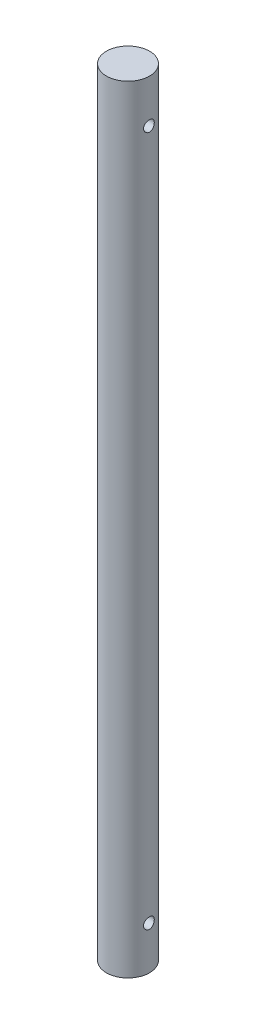
ISO-10303-21;
HEADER;
FILE_DESCRIPTION(('STEP AP214'),'2;1');
FILE_NAME('part.step','',(''),(''),'','','');
FILE_SCHEMA(('AUTOMOTIVE_DESIGN { 1 0 10303 214 1 1 1 1 }'));
ENDSEC;
DATA;
#1=APPLICATION_CONTEXT('core data for automotive mechanical design processes');
#2=APPLICATION_PROTOCOL_DEFINITION('international standard','automotive_design',2000,#1);
#3=PRODUCT_CONTEXT('',#1,'mechanical');
#4=PRODUCT('Part','Part','',(#3));
#5=PRODUCT_RELATED_PRODUCT_CATEGORY('part','',(#4));
#6=PRODUCT_DEFINITION_FORMATION('','',#4);
#7=PRODUCT_DEFINITION_CONTEXT('part definition',#1,'design');
#8=PRODUCT_DEFINITION('design','',#6,#7);
#9=PRODUCT_DEFINITION_SHAPE('','',#8);
#10=(LENGTH_UNIT() NAMED_UNIT(*) SI_UNIT(.MILLI.,.METRE.));
#11=(NAMED_UNIT(*) PLANE_ANGLE_UNIT() SI_UNIT($,.RADIAN.));
#12=(NAMED_UNIT(*) SI_UNIT($,.STERADIAN.) SOLID_ANGLE_UNIT());
#13=UNCERTAINTY_MEASURE_WITH_UNIT(LENGTH_MEASURE(1.E-05),#10,'distance_accuracy_value','');
#14=(GEOMETRIC_REPRESENTATION_CONTEXT(3) GLOBAL_UNCERTAINTY_ASSIGNED_CONTEXT((#13)) GLOBAL_UNIT_ASSIGNED_CONTEXT((#10,
#11,#12)) REPRESENTATION_CONTEXT('',''));
#15=CARTESIAN_POINT('',(0.,0.,0.));
#16=DIRECTION('',(0.,0.,1.));
#17=DIRECTION('',(1.,0.,0.));
#18=AXIS2_PLACEMENT_3D('',#15,#16,#17);
#19=CARTESIAN_POINT('',(0.,914.4,0.));
#20=DIRECTION('',(0.,-1.,0.));
#21=DIRECTION('',(0.,0.,-1.));
#22=AXIS2_PLACEMENT_3D('',#19,#20,#21);
#23=CYLINDRICAL_SURFACE('',#22,25.4);
#24=CARTESIAN_POINT('',(-24.5934442484171,50.8,-6.35));
#25=CARTESIAN_POINT('',(-24.5934406881185,50.9753809478709,-6.35000528556476));
#26=CARTESIAN_POINT('',(-24.5953234043176,51.1507045038508,-6.34273309524765));
#27=CARTESIAN_POINT('',(-24.6027886856043,51.5001205041009,-6.31371849265363));
#28=CARTESIAN_POINT('',(-24.6083716749099,51.6742128049008,-6.2919744212459));
#29=CARTESIAN_POINT('',(-24.6230748088789,52.0199034531831,-6.23418528983497));
#30=CARTESIAN_POINT('',(-24.6321960945666,52.1915009776153,-6.19813561649682));
#31=CARTESIAN_POINT('',(-24.6537047042707,52.5310008319188,-6.11202207752963));
#32=CARTESIAN_POINT('',(-24.6660932364349,52.6989017699476,-6.06195302745435));
#33=CARTESIAN_POINT('',(-24.6937457456566,53.0295003900433,-5.94830490839853));
#34=CARTESIAN_POINT('',(-24.7090048357899,53.1922063734196,-5.88474877702497));
#35=CARTESIAN_POINT('',(-24.7419779358074,53.5116840133042,-5.7445376552918));
#36=CARTESIAN_POINT('',(-24.7596928524026,53.6684534506488,-5.66787782449343));
#37=CARTESIAN_POINT('',(-24.7970663241636,53.9749214396965,-5.50206487626491));
#38=CARTESIAN_POINT('',(-24.8167241867281,54.1246224831482,-5.41291620603053));
#39=CARTESIAN_POINT('',(-24.8574530276887,54.4161182506485,-5.22268993895708));
#40=CARTESIAN_POINT('',(-24.8785245362001,54.5579099717937,-5.12160785618681));
#41=CARTESIAN_POINT('',(-24.9219211919164,54.8353179753805,-4.90613414395909));
#42=CARTESIAN_POINT('',(-24.9442627651316,54.9707601236242,-4.79152157744859));
#43=CARTESIAN_POINT('',(-24.9892006656756,55.2316099102635,-4.55134895600639));
#44=CARTESIAN_POINT('',(-25.0117970844885,55.3570138052799,-4.42578485325958));
#45=CARTESIAN_POINT('',(-25.0566084802586,55.5968749991879,-4.16460304463346));
#46=CARTESIAN_POINT('',(-25.0788235588208,55.7113352522631,-4.02898806958627));
#47=CARTESIAN_POINT('',(-25.1222781225302,55.9286154460513,-3.74850445562388));
#48=CARTESIAN_POINT('',(-25.1435172452899,56.0314310833635,-3.60363242639595));
#49=CARTESIAN_POINT('',(-25.1847117192072,56.2259903922436,-3.30356479587755));
#50=CARTESIAN_POINT('',(-25.2046452842228,56.3175615021777,-3.14825423313342));
#51=CARTESIAN_POINT('',(-25.2423375460957,56.4872623108398,-2.83020069429101));
#52=CARTESIAN_POINT('',(-25.2600962449084,56.5653920216539,-2.66745772487585));
#53=CARTESIAN_POINT('',(-25.2929297289925,56.7075868220732,-2.33569777096007));
#54=CARTESIAN_POINT('',(-25.3080048336936,56.7716535858119,-2.16668153606842));
#55=CARTESIAN_POINT('',(-25.3350387694815,56.8852060962506,-1.82357341907634));
#56=CARTESIAN_POINT('',(-25.3469976007183,56.9346918436528,-1.64948153722034));
#57=CARTESIAN_POINT('',(-25.3672410071466,57.0177977117507,-1.30111425103593));
#58=CARTESIAN_POINT('',(-25.3755956955843,57.0517214848189,-1.12691535020305));
#59=CARTESIAN_POINT('',(-25.3887474994447,57.1048919129797,-0.776098045700244));
#60=CARTESIAN_POINT('',(-25.3935433897817,57.1241335139256,-0.599478830147043));
#61=CARTESIAN_POINT('',(-25.3994326143973,57.1477413018827,-0.245262951434046));
#62=CARTESIAN_POINT('',(-25.4005277836517,57.1521148611118,-0.067666816442157));
#63=CARTESIAN_POINT('',(-25.3989975519053,57.1459863468102,0.287270447782051));
#64=CARTESIAN_POINT('',(-25.3963707890385,57.1354788282495,0.464611459893163));
#65=CARTESIAN_POINT('',(-25.3831796615053,57.0824973089046,0.986274984276417));
#66=CARTESIAN_POINT('',(-25.3674351284754,57.0190970451158,1.32859320268169));
#67=CARTESIAN_POINT('',(-25.3235693788275,56.8376536633609,1.997374640484));
#68=CARTESIAN_POINT('',(-25.2954475033714,56.7196076366174,2.32383701485701));
#69=CARTESIAN_POINT('',(-25.2295021677704,56.4311732833029,2.95531715335712));
#70=CARTESIAN_POINT('',(-25.1915933450496,56.2603216563659,3.26011450287544));
#71=CARTESIAN_POINT('',(-25.1101837119969,55.8714766252467,3.83715433672366));
#72=CARTESIAN_POINT('',(-25.0666819293206,55.6534750194644,4.10939114443232));
#73=CARTESIAN_POINT('',(-24.9774382864578,55.1695397813881,4.6213639707933));
#74=CARTESIAN_POINT('',(-24.9316676642111,54.9024685697296,4.86002095349375));
#75=CARTESIAN_POINT('',(-24.8441221170721,54.331616070915,5.28940029601336));
#76=CARTESIAN_POINT('',(-24.8023473789918,54.0278330689441,5.48012041540997));
#77=CARTESIAN_POINT('',(-24.7274206158047,53.3900633123974,5.80890453638017));
#78=CARTESIAN_POINT('',(-24.6943113835849,53.0559372452995,5.94670872944325));
#79=CARTESIAN_POINT('',(-24.6410134587475,52.3682329110486,6.16385371173043));
#80=CARTESIAN_POINT('',(-24.6208220013423,52.0146588239546,6.24320701173318));
#81=CARTESIAN_POINT('',(-24.5962260426512,51.3081028676093,6.3394072820919));
#82=CARTESIAN_POINT('',(-24.5914186592818,50.9553520107603,6.35784982289844));
#83=CARTESIAN_POINT('',(-24.5970385221954,50.2518122752274,6.33607313676639));
#84=CARTESIAN_POINT('',(-24.6074643660761,49.9010232189204,6.29585930985405));
#85=CARTESIAN_POINT('',(-24.6419898794769,49.2172897885605,6.15931075383293));
#86=CARTESIAN_POINT('',(-24.6658630331987,48.8841473542729,6.06390501416597));
#87=CARTESIAN_POINT('',(-24.7243782548382,48.2385840172845,5.82070964667977));
#88=CARTESIAN_POINT('',(-24.7590215983708,47.926165574442,5.67291381351808));
#89=CARTESIAN_POINT('',(-24.8360218405114,47.3241594576116,5.32579856478302));
#90=CARTESIAN_POINT('',(-24.8785167255263,47.0351398888399,5.12552527766306));
#91=CARTESIAN_POINT('',(-24.9660940671299,46.4942204157473,4.68032883655162));
#92=CARTESIAN_POINT('',(-25.0111769481167,46.2423266238784,4.43539834493799));
#93=CARTESIAN_POINT('',(-25.1002134355064,45.7763643264866,3.90058368132566));
#94=CARTESIAN_POINT('',(-25.1441105613535,45.5633999578719,3.60972805422304));
#95=CARTESIAN_POINT('',(-25.2246715728875,45.1892863820597,2.99525388249782));
#96=CARTESIAN_POINT('',(-25.2613358358248,45.0281344721623,2.67163704796059));
#97=CARTESIAN_POINT('',(-25.3076823978676,44.8296326980476,2.17011561302403));
#98=CARTESIAN_POINT('',(-25.3216590985684,44.7707876910366,2.00081638924334));
#99=CARTESIAN_POINT('',(-25.3464334563288,44.6675675546826,1.65765281439843));
#100=CARTESIAN_POINT('',(-25.3572323126395,44.6231869660935,1.48379021250493));
#101=CARTESIAN_POINT('',(-25.3753376657257,44.5492768101397,1.13276160408528));
#102=CARTESIAN_POINT('',(-25.382644028125,44.5197478141988,0.955595470725737));
#103=CARTESIAN_POINT('',(-25.3935544964002,44.4757951724409,0.599288254526933));
#104=CARTESIAN_POINT('',(-25.3971587683194,44.4613708491602,0.420147260626856));
#105=CARTESIAN_POINT('',(-25.4005141700697,44.4479405908756,0.0661111819275202));
#106=CARTESIAN_POINT('',(-25.4003668944698,44.4485281254545,-0.10876767035337));
#107=CARTESIAN_POINT('',(-25.3964731394376,44.464117641675,-0.457838515402443));
#108=CARTESIAN_POINT('',(-25.3927267413664,44.4791192974735,-0.632030523607924));
#109=CARTESIAN_POINT('',(-25.381737214286,44.5234131007025,-0.978500451600923));
#110=CARTESIAN_POINT('',(-25.3744935752755,44.5527073324207,-1.1507780884666));
#111=CARTESIAN_POINT('',(-25.3567112330477,44.6253306122068,-1.49211023654173));
#112=CARTESIAN_POINT('',(-25.3461736961635,44.6686546926549,-1.66116586618294));
#113=CARTESIAN_POINT('',(-25.3221503510037,44.7687361368414,-1.99409594859921));
#114=CARTESIAN_POINT('',(-25.3086797521527,44.8254243218663,-2.15799231396639));
#115=CARTESIAN_POINT('',(-25.2791237482496,44.9518914229815,-2.48034111584386));
#116=CARTESIAN_POINT('',(-25.2630392541927,45.021665779578,-2.6387954257971));
#117=CARTESIAN_POINT('',(-25.2286684007692,45.1738376560449,-2.94935794716979));
#118=CARTESIAN_POINT('',(-25.2103810743487,45.256240724334,-3.10146333163536));
#119=CARTESIAN_POINT('',(-25.1720946992425,45.4330367936962,-3.39823934801074));
#120=CARTESIAN_POINT('',(-25.1520962157775,45.5274258405706,-3.54291240985027));
#121=CARTESIAN_POINT('',(-25.1103996458826,45.7300166526754,-3.8274011378101));
#122=CARTESIAN_POINT('',(-25.0886720503653,45.8384985549038,-3.96701305274727));
#123=CARTESIAN_POINT('',(-25.0445573309951,46.0666219612211,-4.23660272299123));
#124=CARTESIAN_POINT('',(-25.0221704338453,46.1862596593084,-4.36658373709079));
#125=CARTESIAN_POINT('',(-24.9773251762942,46.4360145001078,-4.61620195233372));
#126=CARTESIAN_POINT('',(-24.95486678088,46.5661379325281,-4.73583285456489));
#127=CARTESIAN_POINT('',(-24.9105163976351,46.8359086921902,-4.96383520471539));
#128=CARTESIAN_POINT('',(-24.8886242076656,46.9755525539932,-5.07221071373634));
#129=CARTESIAN_POINT('',(-24.8455987318646,47.2662589119641,-5.27897630798796));
#130=CARTESIAN_POINT('',(-24.8244878935688,47.4174884307017,-5.37713643646692));
#131=CARTESIAN_POINT('',(-24.7841040455329,47.7278702794577,-5.56030411521959));
#132=CARTESIAN_POINT('',(-24.7648303614153,47.8870196693655,-5.64531649891979));
#133=CARTESIAN_POINT('',(-24.7286971182673,48.2121383582051,-5.80154934331595));
#134=CARTESIAN_POINT('',(-24.7118364977158,48.3781046167463,-5.87277587338087));
#135=CARTESIAN_POINT('',(-24.6810367960965,48.7156849794063,-6.00089532761594));
#136=CARTESIAN_POINT('',(-24.6670972696792,48.8872982179648,-6.05779043701961));
#137=CARTESIAN_POINT('',(-24.6349649898209,49.34302124655,-6.18752575464412));
#138=CARTESIAN_POINT('',(-24.6195019035294,49.6308467521149,-6.24834660818853));
#139=CARTESIAN_POINT('',(-24.598744947343,50.2125021534874,-6.32957758207711));
#140=CARTESIAN_POINT('',(-24.5934502099964,50.5063315349488,-6.34999114953073));
#141=CARTESIAN_POINT('',(-24.5934442484171,50.8,-6.35));
#142=B_SPLINE_CURVE_WITH_KNOTS('',3,(#24,#25,#26,#27,#28,#29,#30,#31,#32,#33,#34,#35,#36,#37,
#38,#39,#40,#41,#42,#43,#44,#45,#46,#47,#48,#49,#50,#51,#52,#53,#54,#55,#56,#57,#58,#59,#60,#61,
#62,#63,#64,#65,#66,#67,#68,#69,#70,#71,#72,#73,#74,#75,#76,#77,#78,#79,#80,#81,#82,#83,#84,#85,
#86,#87,#88,#89,#90,#91,#92,#93,#94,#95,#96,#97,#98,#99,#100,#101,#102,#103,#104,#105,#106,#107,
#108,#109,#110,#111,#112,#113,#114,#115,#116,#117,#118,#119,#120,#121,#122,#123,#124,#125,#126,
#127,#128,#129,#130,#131,#132,#133,#134,#135,#136,#137,#138,#139,#140,#141),.UNSPECIFIED.,.T.,
.F.,(4,2,2,2,2,2,2,2,2,2,2,2,2,2,2,2,2,2,2,2,2,2,2,2,2,2,2,2,2,2,2,2,2,2,2,2,2,2,2,2,2,2,2,2,2,
2,2,2,2,2,2,2,2,2,2,2,2,2,4),(0.,0.525883394114353,1.05182708859082,1.577940529772,
2.1042487882799,2.62966902200645,3.15528376434758,3.68071181216897,4.20633800822294,
4.74220479035222,5.27827048128823,5.8141910528538,6.35030903814495,6.89383270838731,
7.43735588990934,7.98081433219772,8.52427274831311,9.05662154775777,9.58915351877736,
10.1214213988735,10.6538840876736,11.6940169838559,12.7342052523663,13.7837921176196,
14.8335617024671,15.9117429624832,16.9899746040317,18.0734344846001,19.1566623949116,
20.2112799106319,21.2658003422153,22.3030671989806,23.3404569558507,24.3981973965693,
25.4561117914268,26.5404965182658,27.6248246710234,28.1636112333749,28.7021942076002,
29.2407979025403,29.7793774393931,30.3033877622349,30.8273862396688,31.3514611547069,
31.8753507104002,32.396585719853,32.9176394564633,33.4389227775759,33.9600345708791,
34.4938220216419,35.0274280228545,35.5613565167156,36.0950916875522,36.6390098130349,
37.1827275034073,37.7262052690346,38.2696001157562,39.1502462033482,40.0308171605719),.UNSPECIFIED.);
#143=CARTESIAN_POINT('',(-24.5934442484171,50.8,-6.35));
#144=VERTEX_POINT('',#143);
#145=EDGE_CURVE('E10',#144,#144,#142,.T.);
#146=ORIENTED_EDGE('',*,*,#145,.T.);
#147=EDGE_LOOP('',(#146));
#148=FACE_BOUND('',#147,.T.);
#149=CARTESIAN_POINT('',(24.5934442484171,50.8,-6.35));
#150=CARTESIAN_POINT('',(24.5934406881185,50.6246190521291,-6.35000528556476));
#151=CARTESIAN_POINT('',(24.5953234043176,50.4492954961492,-6.34273309524765));
#152=CARTESIAN_POINT('',(24.6027886856043,50.0998794958991,-6.31371849265363));
#153=CARTESIAN_POINT('',(24.6083716749099,49.9257871950992,-6.2919744212459));
#154=CARTESIAN_POINT('',(24.6230748088789,49.5800965468169,-6.23418528983497));
#155=CARTESIAN_POINT('',(24.6321960945666,49.4084990223847,-6.19813561649682));
#156=CARTESIAN_POINT('',(24.6537047042707,49.0689991680812,-6.11202207752963));
#157=CARTESIAN_POINT('',(24.6660932364349,48.9010982300523,-6.06195302745435));
#158=CARTESIAN_POINT('',(24.6937457456566,48.5704996099567,-5.94830490839853));
#159=CARTESIAN_POINT('',(24.7090048357899,48.4077936265804,-5.88474877702497));
#160=CARTESIAN_POINT('',(24.7419779358074,48.0883159866958,-5.7445376552918));
#161=CARTESIAN_POINT('',(24.7596928524026,47.9315465493512,-5.66787782449343));
#162=CARTESIAN_POINT('',(24.7970663241636,47.6250785603035,-5.50206487626491));
#163=CARTESIAN_POINT('',(24.8167241867281,47.4753775168518,-5.41291620603053));
#164=CARTESIAN_POINT('',(24.8574530276887,47.1838817493515,-5.22268993895708));
#165=CARTESIAN_POINT('',(24.8785245362001,47.0420900282063,-5.12160785618682));
#166=CARTESIAN_POINT('',(24.9219211919164,46.7646820246195,-4.90613414395909));
#167=CARTESIAN_POINT('',(24.9442627651316,46.6292398763758,-4.79152157744859));
#168=CARTESIAN_POINT('',(24.9892006656756,46.3683900897365,-4.55134895600639));
#169=CARTESIAN_POINT('',(25.0117970844885,46.2429861947201,-4.42578485325958));
#170=CARTESIAN_POINT('',(25.0566084802586,46.0031250008121,-4.16460304463346));
#171=CARTESIAN_POINT('',(25.0788235588208,45.8886647477369,-4.02898806958627));
#172=CARTESIAN_POINT('',(25.1222781225302,45.6713845539487,-3.74850445562388));
#173=CARTESIAN_POINT('',(25.1435172452899,45.5685689166365,-3.60363242639595));
#174=CARTESIAN_POINT('',(25.1847117192072,45.3740096077564,-3.30356479587755));
#175=CARTESIAN_POINT('',(25.2046452842228,45.2824384978223,-3.14825423313343));
#176=CARTESIAN_POINT('',(25.2423375460957,45.1127376891602,-2.83020069429102));
#177=CARTESIAN_POINT('',(25.2600962449084,45.0346079783461,-2.66745772487585));
#178=CARTESIAN_POINT('',(25.2929297289925,44.8924131779268,-2.33569777096007));
#179=CARTESIAN_POINT('',(25.3080048336936,44.8283464141881,-2.16668153606843));
#180=CARTESIAN_POINT('',(25.3350387694815,44.7147939037494,-1.82357341907634));
#181=CARTESIAN_POINT('',(25.3469976007183,44.6653081563472,-1.64948153722034));
#182=CARTESIAN_POINT('',(25.3672410071466,44.5822022882493,-1.30111425103593));
#183=CARTESIAN_POINT('',(25.3755956955843,44.5482785151811,-1.12691535020305));
#184=CARTESIAN_POINT('',(25.3887474994447,44.4951080870203,-0.776098045700245));
#185=CARTESIAN_POINT('',(25.3935433897817,44.4758664860744,-0.599478830147044));
#186=CARTESIAN_POINT('',(25.3994326143973,44.4522586981173,-0.245262951434046));
#187=CARTESIAN_POINT('',(25.4005277836517,44.4478851388882,-0.067666816442157));
#188=CARTESIAN_POINT('',(25.3989975519053,44.4540136531898,0.287270447782051));
#189=CARTESIAN_POINT('',(25.3963707890385,44.4645211717505,0.464611459893163));
#190=CARTESIAN_POINT('',(25.3831796615053,44.5175026910954,0.986274984276417));
#191=CARTESIAN_POINT('',(25.3674351284754,44.5809029548842,1.32859320268169));
#192=CARTESIAN_POINT('',(25.3235693788275,44.7623463366391,1.997374640484));
#193=CARTESIAN_POINT('',(25.2954475033714,44.8803923633826,2.32383701485701));
#194=CARTESIAN_POINT('',(25.2295021677704,45.1688267166971,2.95531715335712));
#195=CARTESIAN_POINT('',(25.1915933450496,45.3396783436341,3.26011450287544));
#196=CARTESIAN_POINT('',(25.1101837119969,45.7285233747533,3.83715433672366));
#197=CARTESIAN_POINT('',(25.0666819293206,45.9465249805356,4.10939114443232));
#198=CARTESIAN_POINT('',(24.9774382864578,46.4304602186119,4.6213639707933));
#199=CARTESIAN_POINT('',(24.9316676642111,46.6975314302704,4.86002095349375));
#200=CARTESIAN_POINT('',(24.8441221170721,47.268383929085,5.28940029601335));
#201=CARTESIAN_POINT('',(24.8023473789918,47.5721669310559,5.48012041540997));
#202=CARTESIAN_POINT('',(24.7274206158047,48.2099366876026,5.80890453638017));
#203=CARTESIAN_POINT('',(24.6943113835849,48.5440627547005,5.94670872944324));
#204=CARTESIAN_POINT('',(24.6410134587475,49.2317670889514,6.16385371173043));
#205=CARTESIAN_POINT('',(24.6208220013423,49.5853411760454,6.24320701173318));
#206=CARTESIAN_POINT('',(24.5962260426512,50.2918971323907,6.3394072820919));
#207=CARTESIAN_POINT('',(24.5914186592818,50.6446479892397,6.35784982289844));
#208=CARTESIAN_POINT('',(24.5970385221954,51.3481877247726,6.33607313676639));
#209=CARTESIAN_POINT('',(24.6074643660761,51.6989767810796,6.29585930985405));
#210=CARTESIAN_POINT('',(24.6419898794769,52.3827102114395,6.15931075383293));
#211=CARTESIAN_POINT('',(24.6658630331987,52.7158526457271,6.06390501416597));
#212=CARTESIAN_POINT('',(24.7243782548382,53.3614159827155,5.82070964667977));
#213=CARTESIAN_POINT('',(24.7590215983708,53.673834425558,5.67291381351808));
#214=CARTESIAN_POINT('',(24.8360218405114,54.2758405423884,5.32579856478302));
#215=CARTESIAN_POINT('',(24.8785167255263,54.5648601111601,5.12552527766306));
#216=CARTESIAN_POINT('',(24.9660940671299,55.1057795842527,4.68032883655162));
#217=CARTESIAN_POINT('',(25.0111769481167,55.3576733761216,4.43539834493799));
#218=CARTESIAN_POINT('',(25.1002134355064,55.8236356735134,3.90058368132566));
#219=CARTESIAN_POINT('',(25.1441105613535,56.0366000421281,3.60972805422304));
#220=CARTESIAN_POINT('',(25.2246715728875,56.4107136179403,2.99525388249782));
#221=CARTESIAN_POINT('',(25.2613358358248,56.5718655278377,2.67163704796059));
#222=CARTESIAN_POINT('',(25.3076823978676,56.7703673019524,2.17011561302403));
#223=CARTESIAN_POINT('',(25.3216590985684,56.8292123089634,2.00081638924334));
#224=CARTESIAN_POINT('',(25.3464334563288,56.9324324453174,1.65765281439843));
#225=CARTESIAN_POINT('',(25.3572323126395,56.9768130339065,1.48379021250493));
#226=CARTESIAN_POINT('',(25.3753376657257,57.0507231898603,1.13276160408528));
#227=CARTESIAN_POINT('',(25.382644028125,57.0802521858012,0.955595470725737));
#228=CARTESIAN_POINT('',(25.3935544964002,57.1242048275591,0.599288254526933));
#229=CARTESIAN_POINT('',(25.3971587683194,57.1386291508398,0.420147260626856));
#230=CARTESIAN_POINT('',(25.4005141700697,57.1520594091244,0.0661111819275201));
#231=CARTESIAN_POINT('',(25.4003668944698,57.1514718745455,-0.10876767035337));
#232=CARTESIAN_POINT('',(25.3964731394376,57.135882358325,-0.457838515402443));
#233=CARTESIAN_POINT('',(25.3927267413664,57.1208807025265,-0.632030523607924));
#234=CARTESIAN_POINT('',(25.381737214286,57.0765868992975,-0.978500451600923));
#235=CARTESIAN_POINT('',(25.3744935752755,57.0472926675793,-1.1507780884666));
#236=CARTESIAN_POINT('',(25.3567112330477,56.9746693877932,-1.49211023654173));
#237=CARTESIAN_POINT('',(25.3461736961635,56.9313453073451,-1.66116586618294));
#238=CARTESIAN_POINT('',(25.3221503510037,56.8312638631586,-1.99409594859921));
#239=CARTESIAN_POINT('',(25.3086797521527,56.7745756781337,-2.15799231396639));
#240=CARTESIAN_POINT('',(25.2791237482496,56.6481085770185,-2.48034111584386));
#241=CARTESIAN_POINT('',(25.2630392541927,56.578334220422,-2.63879542579711));
#242=CARTESIAN_POINT('',(25.2286684007692,56.4261623439551,-2.94935794716979));
#243=CARTESIAN_POINT('',(25.2103810743487,56.343759275666,-3.10146333163536));
#244=CARTESIAN_POINT('',(25.1720946992425,56.1669632063038,-3.39823934801074));
#245=CARTESIAN_POINT('',(25.1520962157775,56.0725741594294,-3.54291240985027));
#246=CARTESIAN_POINT('',(25.1103996458826,55.8699833473246,-3.8274011378101));
#247=CARTESIAN_POINT('',(25.0886720503653,55.7615014450962,-3.96701305274727));
#248=CARTESIAN_POINT('',(25.0445573309951,55.5333780387789,-4.23660272299123));
#249=CARTESIAN_POINT('',(25.0221704338453,55.4137403406916,-4.3665837370908));
#250=CARTESIAN_POINT('',(24.9773251762942,55.1639854998922,-4.61620195233373));
#251=CARTESIAN_POINT('',(24.95486678088,55.0338620674719,-4.73583285456489));
#252=CARTESIAN_POINT('',(24.9105163976351,54.7640913078098,-4.96383520471539));
#253=CARTESIAN_POINT('',(24.8886242076656,54.6244474460068,-5.07221071373634));
#254=CARTESIAN_POINT('',(24.8455987318646,54.3337410880359,-5.27897630798796));
#255=CARTESIAN_POINT('',(24.8244878935688,54.1825115692983,-5.37713643646692));
#256=CARTESIAN_POINT('',(24.7841040455329,53.8721297205423,-5.5603041152196));
#257=CARTESIAN_POINT('',(24.7648303614153,53.7129803306345,-5.64531649891979));
#258=CARTESIAN_POINT('',(24.7286971182673,53.3878616417949,-5.80154934331595));
#259=CARTESIAN_POINT('',(24.7118364977158,53.2218953832537,-5.87277587338087));
#260=CARTESIAN_POINT('',(24.6810367960965,52.8843150205937,-6.00089532761594));
#261=CARTESIAN_POINT('',(24.6670972696792,52.7127017820352,-6.05779043701961));
#262=CARTESIAN_POINT('',(24.6349649898209,52.25697875345,-6.18752575464412));
#263=CARTESIAN_POINT('',(24.6195019035294,51.9691532478851,-6.24834660818853));
#264=CARTESIAN_POINT('',(24.598744947343,51.3874978465126,-6.32957758207711));
#265=CARTESIAN_POINT('',(24.5934502099964,51.0936684650512,-6.34999114953073));
#266=CARTESIAN_POINT('',(24.5934442484171,50.8,-6.35));
#267=B_SPLINE_CURVE_WITH_KNOTS('',3,(#149,#150,#151,#152,#153,#154,#155,#156,#157,#158,#159,
#160,#161,#162,#163,#164,#165,#166,#167,#168,#169,#170,#171,#172,#173,#174,#175,#176,#177,#178,
#179,#180,#181,#182,#183,#184,#185,#186,#187,#188,#189,#190,#191,#192,#193,#194,#195,#196,#197,
#198,#199,#200,#201,#202,#203,#204,#205,#206,#207,#208,#209,#210,#211,#212,#213,#214,#215,#216,
#217,#218,#219,#220,#221,#222,#223,#224,#225,#226,#227,#228,#229,#230,#231,#232,#233,#234,#235,
#236,#237,#238,#239,#240,#241,#242,#243,#244,#245,#246,#247,#248,#249,#250,#251,#252,#253,#254,
#255,#256,#257,#258,#259,#260,#261,#262,#263,#264,#265,#266),.UNSPECIFIED.,.T.,.F.,(4,2,2,2,2,2,
2,2,2,2,2,2,2,2,2,2,2,2,2,2,2,2,2,2,2,2,2,2,2,2,2,2,2,2,2,2,2,2,2,2,2,2,2,2,2,2,2,2,2,2,2,2,2,2,
2,2,2,2,4),(0.,0.525883394114353,1.05182708859082,1.577940529772,2.1042487882799,
2.62966902200645,3.15528376434758,3.68071181216897,4.20633800822294,4.74220479035222,
5.27827048128823,5.8141910528538,6.35030903814495,6.8938327083873,7.43735588990934,
7.98081433219771,8.52427274831311,9.05662154775777,9.58915351877736,10.1214213988735,
10.6538840876736,11.6940169838559,12.7342052523662,13.7837921176196,14.8335617024671,
15.9117429624832,16.9899746040317,18.0734344846001,19.1566623949116,20.2112799106319,
21.2658003422153,22.3030671989806,23.3404569558507,24.3981973965693,25.4561117914268,
26.5404965182658,27.6248246710234,28.1636112333749,28.7021942076002,29.2407979025403,
29.779377439393,30.3033877622349,30.8273862396688,31.3514611547069,31.8753507104002,
32.396585719853,32.9176394564633,33.4389227775759,33.9600345708791,34.4938220216419,
35.0274280228545,35.5613565167156,36.0950916875522,36.639009813035,37.1827275034073,
37.7262052690346,38.2696001157562,39.1502462033482,40.0308171605719),.UNSPECIFIED.);
#268=CARTESIAN_POINT('',(24.5934442484171,50.8,-6.35));
#269=VERTEX_POINT('',#268);
#270=EDGE_CURVE('E42',#269,#269,#267,.T.);
#271=ORIENTED_EDGE('',*,*,#270,.T.);
#272=EDGE_LOOP('',(#271));
#273=FACE_BOUND('',#272,.T.);
#274=CARTESIAN_POINT('',(-24.5934442484171,863.6,-6.35));
#275=CARTESIAN_POINT('',(-24.5934406881185,863.775380947871,-6.35000528556476));
#276=CARTESIAN_POINT('',(-24.5953234043176,863.950704503851,-6.34273309524765));
#277=CARTESIAN_POINT('',(-24.6027886856043,864.300120504101,-6.31371849265363));
#278=CARTESIAN_POINT('',(-24.6083716749099,864.474212804901,-6.29197442124591));
#279=CARTESIAN_POINT('',(-24.6230748088789,864.819903453183,-6.23418528983499));
#280=CARTESIAN_POINT('',(-24.6321960945666,864.991500977615,-6.19813561649684));
#281=CARTESIAN_POINT('',(-24.6537047042707,865.331000831919,-6.11202207752965));
#282=CARTESIAN_POINT('',(-24.6660932364349,865.498901769948,-6.06195302745436));
#283=CARTESIAN_POINT('',(-24.6937457456566,865.829500390043,-5.94830490839855));
#284=CARTESIAN_POINT('',(-24.7090048357899,865.99220637342,-5.88474877702498));
#285=CARTESIAN_POINT('',(-24.7419779358074,866.311684013304,-5.74453765529181));
#286=CARTESIAN_POINT('',(-24.7596928524026,866.468453450649,-5.66787782449343));
#287=CARTESIAN_POINT('',(-24.7970663241636,866.774921439697,-5.50206487626493));
#288=CARTESIAN_POINT('',(-24.8167241867281,866.924622483148,-5.41291620603057));
#289=CARTESIAN_POINT('',(-24.8574530276887,867.216118250648,-5.22268993895712));
#290=CARTESIAN_POINT('',(-24.8785245362001,867.357909971794,-5.12160785618683));
#291=CARTESIAN_POINT('',(-24.9219211919164,867.635317975381,-4.90613414395907));
#292=CARTESIAN_POINT('',(-24.9442627651316,867.770760123624,-4.79152157744855));
#293=CARTESIAN_POINT('',(-24.9892006656756,868.031609910264,-4.55134895600634));
#294=CARTESIAN_POINT('',(-25.0117970844885,868.15701380528,-4.42578485325956));
#295=CARTESIAN_POINT('',(-25.0566084802586,868.396874999188,-4.16460304463348));
#296=CARTESIAN_POINT('',(-25.0788235588208,868.511335252263,-4.02898806958632));
#297=CARTESIAN_POINT('',(-25.1222781225302,868.728615446051,-3.74850445562394));
#298=CARTESIAN_POINT('',(-25.1435172452899,868.831431083363,-3.60363242639601));
#299=CARTESIAN_POINT('',(-25.1847117192072,869.025990392244,-3.30356479587761));
#300=CARTESIAN_POINT('',(-25.2046452842228,869.117561502178,-3.14825423313348));
#301=CARTESIAN_POINT('',(-25.2423375460957,869.28726231084,-2.83020069429106));
#302=CARTESIAN_POINT('',(-25.2600962449084,869.365392021654,-2.66745772487591));
#303=CARTESIAN_POINT('',(-25.2929297289925,869.507586822073,-2.33569777096013));
#304=CARTESIAN_POINT('',(-25.3080048336936,869.571653585812,-2.16668153606848));
#305=CARTESIAN_POINT('',(-25.3350387694815,869.685206096251,-1.82357341907639));
#306=CARTESIAN_POINT('',(-25.3469976007183,869.734691843653,-1.6494815372204));
#307=CARTESIAN_POINT('',(-25.3672410071466,869.817797711751,-1.30111425103597));
#308=CARTESIAN_POINT('',(-25.3755956955843,869.851721484819,-1.1269153502031));
#309=CARTESIAN_POINT('',(-25.3887474994447,869.90489191298,-0.776098045700291));
#310=CARTESIAN_POINT('',(-25.3935433897817,869.924133513926,-0.599478830147095));
#311=CARTESIAN_POINT('',(-25.3994326143973,869.947741301883,-0.245262951434105));
#312=CARTESIAN_POINT('',(-25.4005277836517,869.952114861112,-0.067666816442219));
#313=CARTESIAN_POINT('',(-25.3989975519053,869.94598634681,0.287270447781985));
#314=CARTESIAN_POINT('',(-25.3963707890385,869.93547882825,0.464611459893097));
#315=CARTESIAN_POINT('',(-25.3831796615053,869.882497308905,0.986274984276351));
#316=CARTESIAN_POINT('',(-25.3674351284754,869.819097045116,1.32859320268162));
#317=CARTESIAN_POINT('',(-25.3235693788275,869.637653663361,1.99737464048393));
#318=CARTESIAN_POINT('',(-25.2954475033714,869.519607636617,2.32383701485694));
#319=CARTESIAN_POINT('',(-25.2295021677704,869.231173283303,2.95531715335702));
#320=CARTESIAN_POINT('',(-25.1915933450496,869.060321656366,3.26011450287531));
#321=CARTESIAN_POINT('',(-25.1101837119969,868.671476625247,3.83715433672354));
#322=CARTESIAN_POINT('',(-25.0666819293206,868.453475019464,4.10939114443224));
#323=CARTESIAN_POINT('',(-24.9774382864578,867.969539781388,4.62136397079324));
#324=CARTESIAN_POINT('',(-24.9316676642111,867.70246856973,4.86002095349367));
#325=CARTESIAN_POINT('',(-24.8441221170722,867.131616070915,5.28940029601328));
#326=CARTESIAN_POINT('',(-24.8023473789919,866.827833068944,5.48012041540991));
#327=CARTESIAN_POINT('',(-24.7274206158047,866.190063312397,5.80890453638013));
#328=CARTESIAN_POINT('',(-24.6943113835849,865.8559372453,5.94670872944322));
#329=CARTESIAN_POINT('',(-24.6410134587475,865.168232911049,6.1638537117304));
#330=CARTESIAN_POINT('',(-24.6208220013423,864.814658823955,6.24320701173316));
#331=CARTESIAN_POINT('',(-24.5962260426512,864.108102867609,6.33940728209189));
#332=CARTESIAN_POINT('',(-24.5914186592818,863.75535201076,6.35784982289843));
#333=CARTESIAN_POINT('',(-24.5970385221954,863.051812275228,6.3360731367664));
#334=CARTESIAN_POINT('',(-24.6074643660761,862.70102321892,6.29585930985406));
#335=CARTESIAN_POINT('',(-24.6419898794769,862.017289788561,6.15931075383292));
#336=CARTESIAN_POINT('',(-24.6658630331987,861.684147354273,6.06390501416596));
#337=CARTESIAN_POINT('',(-24.7243782548382,861.038584017285,5.82070964667978));
#338=CARTESIAN_POINT('',(-24.7590215983708,860.726165574442,5.67291381351808));
#339=CARTESIAN_POINT('',(-24.8360218405114,860.124159457612,5.32579856478302));
#340=CARTESIAN_POINT('',(-24.8785167255263,859.83513988884,5.12552527766308));
#341=CARTESIAN_POINT('',(-24.9660940671298,859.294220415747,4.68032883655166));
#342=CARTESIAN_POINT('',(-25.0111769481167,859.042326623878,4.43539834493804));
#343=CARTESIAN_POINT('',(-25.1002134355064,858.576364326487,3.90058368132572));
#344=CARTESIAN_POINT('',(-25.1441105613534,858.363399957872,3.6097280542231));
#345=CARTESIAN_POINT('',(-25.2246715728875,857.98928638206,2.99525388249789));
#346=CARTESIAN_POINT('',(-25.2613358358248,857.828134472162,2.67163704796066));
#347=CARTESIAN_POINT('',(-25.3076823978676,857.629632698048,2.17011561302411));
#348=CARTESIAN_POINT('',(-25.3216590985684,857.570787691037,2.0008163892434));
#349=CARTESIAN_POINT('',(-25.3464334563288,857.467567554683,1.65765281439849));
#350=CARTESIAN_POINT('',(-25.3572323126395,857.423186966094,1.48379021250499));
#351=CARTESIAN_POINT('',(-25.3753376657257,857.34927681014,1.13276160408534));
#352=CARTESIAN_POINT('',(-25.382644028125,857.319747814199,0.955595470725794));
#353=CARTESIAN_POINT('',(-25.3935544964002,857.275795172441,0.599288254526987));
#354=CARTESIAN_POINT('',(-25.3971587683194,857.26137084916,0.42014726062691));
#355=CARTESIAN_POINT('',(-25.4005141700697,857.247940590876,0.066111181927572));
#356=CARTESIAN_POINT('',(-25.4003668944698,857.248528125454,-0.10876767035332));
#357=CARTESIAN_POINT('',(-25.3964731394376,857.264117641675,-0.457838515402387));
#358=CARTESIAN_POINT('',(-25.3927267413664,857.279119297474,-0.632030523607862));
#359=CARTESIAN_POINT('',(-25.381737214286,857.323413100703,-0.978500451600863));
#360=CARTESIAN_POINT('',(-25.3744935752755,857.352707332421,-1.15077808846655));
#361=CARTESIAN_POINT('',(-25.3567112330477,857.425330612207,-1.49211023654168));
#362=CARTESIAN_POINT('',(-25.3461736961635,857.468654692655,-1.66116586618288));
#363=CARTESIAN_POINT('',(-25.3221503510037,857.568736136841,-1.99409594859914));
#364=CARTESIAN_POINT('',(-25.3086797521527,857.625424321866,-2.15799231396632));
#365=CARTESIAN_POINT('',(-25.2791237482496,857.751891422982,-2.48034111584379));
#366=CARTESIAN_POINT('',(-25.2630392541927,857.821665779578,-2.63879542579704));
#367=CARTESIAN_POINT('',(-25.2286684007692,857.973837656045,-2.94935794716974));
#368=CARTESIAN_POINT('',(-25.2103810743487,858.056240724334,-3.10146333163531));
#369=CARTESIAN_POINT('',(-25.1720946992425,858.233036793696,-3.3982393480107));
#370=CARTESIAN_POINT('',(-25.1520962157775,858.327425840571,-3.54291240985022));
#371=CARTESIAN_POINT('',(-25.1103996458826,858.530016652675,-3.82740113781004));
#372=CARTESIAN_POINT('',(-25.0886720503653,858.638498554904,-3.96701305274721));
#373=CARTESIAN_POINT('',(-25.0445573309951,858.866621961221,-4.23660272299117));
#374=CARTESIAN_POINT('',(-25.0221704338453,858.986259659308,-4.36658373709074));
#375=CARTESIAN_POINT('',(-24.9773251762942,859.236014500108,-4.61620195233367));
#376=CARTESIAN_POINT('',(-24.95486678088,859.366137932528,-4.73583285456483));
#377=CARTESIAN_POINT('',(-24.9105163976351,859.63590869219,-4.96383520471534));
#378=CARTESIAN_POINT('',(-24.8886242076657,859.775552553993,-5.0722107137363));
#379=CARTESIAN_POINT('',(-24.8455987318646,860.066258911964,-5.27897630798791));
#380=CARTESIAN_POINT('',(-24.8244878935689,860.217488430702,-5.37713643646688));
#381=CARTESIAN_POINT('',(-24.7841040455329,860.527870279458,-5.56030411521954));
#382=CARTESIAN_POINT('',(-24.7648303614153,860.687019669365,-5.64531649891974));
#383=CARTESIAN_POINT('',(-24.7286971182673,861.012138358205,-5.80154934331591));
#384=CARTESIAN_POINT('',(-24.7118364977159,861.178104616746,-5.87277587338083));
#385=CARTESIAN_POINT('',(-24.6810367960965,861.515684979406,-6.00089532761591));
#386=CARTESIAN_POINT('',(-24.6670972696792,861.687298217965,-6.05779043701958));
#387=CARTESIAN_POINT('',(-24.6349649898209,862.14302124655,-6.1875257546441));
#388=CARTESIAN_POINT('',(-24.6195019035294,862.430846752115,-6.24834660818851));
#389=CARTESIAN_POINT('',(-24.598744947343,863.012502153487,-6.32957758207711));
#390=CARTESIAN_POINT('',(-24.5934502099964,863.306331534949,-6.34999114953073));
#391=CARTESIAN_POINT('',(-24.5934442484171,863.6,-6.35));
#392=B_SPLINE_CURVE_WITH_KNOTS('',3,(#274,#275,#276,#277,#278,#279,#280,#281,#282,#283,#284,
#285,#286,#287,#288,#289,#290,#291,#292,#293,#294,#295,#296,#297,#298,#299,#300,#301,#302,#303,
#304,#305,#306,#307,#308,#309,#310,#311,#312,#313,#314,#315,#316,#317,#318,#319,#320,#321,#322,
#323,#324,#325,#326,#327,#328,#329,#330,#331,#332,#333,#334,#335,#336,#337,#338,#339,#340,#341,
#342,#343,#344,#345,#346,#347,#348,#349,#350,#351,#352,#353,#354,#355,#356,#357,#358,#359,#360,
#361,#362,#363,#364,#365,#366,#367,#368,#369,#370,#371,#372,#373,#374,#375,#376,#377,#378,#379,
#380,#381,#382,#383,#384,#385,#386,#387,#388,#389,#390,#391),.UNSPECIFIED.,.T.,.F.,(4,2,2,2,2,2,
2,2,2,2,2,2,2,2,2,2,2,2,2,2,2,2,2,2,2,2,2,2,2,2,2,2,2,2,2,2,2,2,2,2,2,2,2,2,2,2,2,2,2,2,2,2,2,2,
2,2,2,2,4),(0.,0.525883394114332,1.05182708859074,1.57794052977188,2.10424878827985,
2.62966902200644,3.15528376434756,3.68071181216891,4.20633800822287,4.74220479035231,
5.27827048128814,5.81419105285378,6.35030903814485,6.89383270838725,7.43735588990928,
7.98081433219767,8.52427274831308,9.05662154775773,9.58915351877731,10.1214213988734,
10.6538840876735,11.6940169838559,12.7342052523662,13.7837921176194,14.833561702467,
15.9117429624831,16.9899746040316,18.0734344846,19.1566623949115,20.2112799106317,
21.2658003422153,22.3030671989805,23.3404569558507,24.3981973965693,25.4561117914268,
26.5404965182657,27.6248246710233,28.1636112333749,28.7021942076001,29.2407979025403,
29.779377439393,30.3033877622348,30.8273862396688,31.3514611547069,31.8753507104002,
32.3965857198529,32.9176394564633,33.4389227775758,33.9600345708791,34.4938220216418,
35.0274280228544,35.5613565167155,36.0950916875521,36.6390098130349,37.1827275034071,
37.7262052690345,38.2696001157561,39.1502462033481,40.0308171605719),.UNSPECIFIED.);
#393=CARTESIAN_POINT('',(-24.5934442484171,863.6,-6.35));
#394=VERTEX_POINT('',#393);
#395=EDGE_CURVE('E46',#394,#394,#392,.T.);
#396=ORIENTED_EDGE('',*,*,#395,.T.);
#397=EDGE_LOOP('',(#396));
#398=FACE_BOUND('',#397,.T.);
#399=CARTESIAN_POINT('',(24.5934442484171,863.6,-6.35));
#400=CARTESIAN_POINT('',(24.5934406881185,863.424619052129,-6.35000528556476));
#401=CARTESIAN_POINT('',(24.5953234043176,863.249295496149,-6.34273309524765));
#402=CARTESIAN_POINT('',(24.6027886856043,862.899879495899,-6.31371849265363));
#403=CARTESIAN_POINT('',(24.6083716749099,862.725787195099,-6.2919744212459));
#404=CARTESIAN_POINT('',(24.6230748088789,862.380096546817,-6.23418528983497));
#405=CARTESIAN_POINT('',(24.6321960945666,862.208499022385,-6.19813561649681));
#406=CARTESIAN_POINT('',(24.6537047042707,861.868999168081,-6.11202207752963));
#407=CARTESIAN_POINT('',(24.6660932364349,861.701098230052,-6.06195302745435));
#408=CARTESIAN_POINT('',(24.6937457456566,861.370499609957,-5.94830490839855));
#409=CARTESIAN_POINT('',(24.7090048357899,861.20779362658,-5.88474877702498));
#410=CARTESIAN_POINT('',(24.7419779358074,860.888315986696,-5.74453765529181));
#411=CARTESIAN_POINT('',(24.7596928524026,860.731546549351,-5.66787782449343));
#412=CARTESIAN_POINT('',(24.7970663241636,860.425078560304,-5.50206487626493));
#413=CARTESIAN_POINT('',(24.8167241867281,860.275377516852,-5.41291620603057));
#414=CARTESIAN_POINT('',(24.8574530276887,859.983881749352,-5.22268993895711));
#415=CARTESIAN_POINT('',(24.8785245362001,859.842090028206,-5.12160785618683));
#416=CARTESIAN_POINT('',(24.9219211919164,859.56468202462,-4.90613414395914));
#417=CARTESIAN_POINT('',(24.9442627651315,859.429239876376,-4.79152157744869));
#418=CARTESIAN_POINT('',(24.9892006656755,859.168390089737,-4.5513489560065));
#419=CARTESIAN_POINT('',(25.0117970844885,859.04298619472,-4.42578485325965));
#420=CARTESIAN_POINT('',(25.0566084802586,858.803125000812,-4.1646030446335));
#421=CARTESIAN_POINT('',(25.0788235588208,858.688664747737,-4.02898806958634));
#422=CARTESIAN_POINT('',(25.1222781225302,858.471384553949,-3.74850445562396));
#423=CARTESIAN_POINT('',(25.1435172452899,858.368568916637,-3.60363242639603));
#424=CARTESIAN_POINT('',(25.1847117192072,858.174009607756,-3.30356479587762));
#425=CARTESIAN_POINT('',(25.2046452842228,858.082438497822,-3.14825423313349));
#426=CARTESIAN_POINT('',(25.2423375460957,857.91273768916,-2.83020069429107));
#427=CARTESIAN_POINT('',(25.2600962449084,857.834607978346,-2.66745772487591));
#428=CARTESIAN_POINT('',(25.2929297289925,857.692413177927,-2.33569777096013));
#429=CARTESIAN_POINT('',(25.3080048336936,857.628346414188,-2.16668153606848));
#430=CARTESIAN_POINT('',(25.3350387694815,857.514793903749,-1.82357341907639));
#431=CARTESIAN_POINT('',(25.3469976007183,857.465308156347,-1.6494815372204));
#432=CARTESIAN_POINT('',(25.3672410071466,857.382202288249,-1.30111425103597));
#433=CARTESIAN_POINT('',(25.3755956955843,857.348278515181,-1.1269153502031));
#434=CARTESIAN_POINT('',(25.3887474994447,857.29510808702,-0.776098045700291));
#435=CARTESIAN_POINT('',(25.3935433897817,857.275866486075,-0.599478830147095));
#436=CARTESIAN_POINT('',(25.3994326143973,857.252258698117,-0.245262951434105));
#437=CARTESIAN_POINT('',(25.4005277836517,857.247885138888,-0.067666816442218));
#438=CARTESIAN_POINT('',(25.3989975519053,857.25401365319,0.287270447781986));
#439=CARTESIAN_POINT('',(25.3963707890385,857.264521171751,0.464611459893097));
#440=CARTESIAN_POINT('',(25.3831796615053,857.317502691095,0.986274984276351));
#441=CARTESIAN_POINT('',(25.3674351284754,857.380902954884,1.32859320268162));
#442=CARTESIAN_POINT('',(25.3235693788275,857.562346336639,1.99737464048393));
#443=CARTESIAN_POINT('',(25.2954475033714,857.680392363383,2.32383701485693));
#444=CARTESIAN_POINT('',(25.2295021677704,857.968826716697,2.95531715335706));
#445=CARTESIAN_POINT('',(25.1915933450496,858.139678343634,3.26011450287539));
#446=CARTESIAN_POINT('',(25.1101837119969,858.528523374753,3.83715433672361));
#447=CARTESIAN_POINT('',(25.0666819293206,858.746524980536,4.10939114443226));
#448=CARTESIAN_POINT('',(24.9774382864578,859.230460218612,4.62136397079323));
#449=CARTESIAN_POINT('',(24.9316676642111,859.49753143027,4.86002095349367));
#450=CARTESIAN_POINT('',(24.8441221170722,860.068383929085,5.28940029601329));
#451=CARTESIAN_POINT('',(24.8023473789919,860.372166931056,5.48012041540991));
#452=CARTESIAN_POINT('',(24.7274206158047,861.009936687603,5.80890453638013));
#453=CARTESIAN_POINT('',(24.6943113835849,861.344062754701,5.94670872944322));
#454=CARTESIAN_POINT('',(24.6410134587475,862.031767088951,6.1638537117304));
#455=CARTESIAN_POINT('',(24.6208220013423,862.385341176045,6.24320701173316));
#456=CARTESIAN_POINT('',(24.5962260426512,863.091897132391,6.3394072820919));
#457=CARTESIAN_POINT('',(24.5914186592818,863.44464798924,6.35784982289844));
#458=CARTESIAN_POINT('',(24.5970385221954,864.148187724773,6.33607313676639));
#459=CARTESIAN_POINT('',(24.6074643660761,864.49897678108,6.29585930985404));
#460=CARTESIAN_POINT('',(24.6419898794769,865.18271021144,6.15931075383291));
#461=CARTESIAN_POINT('',(24.6658630331987,865.515852645727,6.06390501416594));
#462=CARTESIAN_POINT('',(24.7243782548382,866.161415982716,5.82070964667975));
#463=CARTESIAN_POINT('',(24.7590215983708,866.473834425558,5.67291381351807));
#464=CARTESIAN_POINT('',(24.8360218405114,867.075840542388,5.32579856478301));
#465=CARTESIAN_POINT('',(24.8785167255263,867.36486011116,5.12552527766303));
#466=CARTESIAN_POINT('',(24.9660940671299,867.905779584253,4.68032883655161));
#467=CARTESIAN_POINT('',(25.0111769481167,868.157673376122,4.43539834493802));
#468=CARTESIAN_POINT('',(25.1002134355064,868.623635673513,3.90058368132573));
#469=CARTESIAN_POINT('',(25.1441105613534,868.836600042128,3.6097280542231));
#470=CARTESIAN_POINT('',(25.2246715728875,869.21071361794,2.99525388249789));
#471=CARTESIAN_POINT('',(25.2613358358248,869.371865527838,2.67163704796066));
#472=CARTESIAN_POINT('',(25.3076823978676,869.570367301953,2.17011561302411));
#473=CARTESIAN_POINT('',(25.3216590985684,869.629212308963,2.0008163892434));
#474=CARTESIAN_POINT('',(25.3464334563288,869.732432445317,1.65765281439849));
#475=CARTESIAN_POINT('',(25.3572323126395,869.776813033906,1.48379021250499));
#476=CARTESIAN_POINT('',(25.3753376657257,869.85072318986,1.13276160408534));
#477=CARTESIAN_POINT('',(25.382644028125,869.880252185801,0.955595470725803));
#478=CARTESIAN_POINT('',(25.3935544964002,869.924204827559,0.599288254526996));
#479=CARTESIAN_POINT('',(25.3971587683194,869.93862915084,0.420147260626914));
#480=CARTESIAN_POINT('',(25.4005141700697,869.952059409124,0.0661111819275736));
#481=CARTESIAN_POINT('',(25.4003668944698,869.951471874546,-0.108767670353316));
#482=CARTESIAN_POINT('',(25.3964731394376,869.935882358325,-0.457838515402384));
#483=CARTESIAN_POINT('',(25.3927267413664,869.920880702526,-0.632030523607861));
#484=CARTESIAN_POINT('',(25.381737214286,869.876586899298,-0.978500451600863));
#485=CARTESIAN_POINT('',(25.3744935752755,869.847292667579,-1.15077808846655));
#486=CARTESIAN_POINT('',(25.3567112330477,869.774669387793,-1.49211023654168));
#487=CARTESIAN_POINT('',(25.3461736961635,869.731345307345,-1.66116586618288));
#488=CARTESIAN_POINT('',(25.3221503510037,869.631263863159,-1.99409594859914));
#489=CARTESIAN_POINT('',(25.3086797521527,869.574575678134,-2.15799231396632));
#490=CARTESIAN_POINT('',(25.2791237482496,869.448108577019,-2.48034111584379));
#491=CARTESIAN_POINT('',(25.2630392541927,869.378334220422,-2.63879542579704));
#492=CARTESIAN_POINT('',(25.2286684007692,869.226162343955,-2.94935794716974));
#493=CARTESIAN_POINT('',(25.2103810743487,869.143759275666,-3.10146333163532));
#494=CARTESIAN_POINT('',(25.1720946992425,868.966963206304,-3.39823934801071));
#495=CARTESIAN_POINT('',(25.1520962157775,868.872574159429,-3.54291240985022));
#496=CARTESIAN_POINT('',(25.1103996458826,868.669983347325,-3.82740113781002));
#497=CARTESIAN_POINT('',(25.0886720503653,868.561501445096,-3.96701305274718));
#498=CARTESIAN_POINT('',(25.0445573309951,868.333378038779,-4.23660272299116));
#499=CARTESIAN_POINT('',(25.0221704338453,868.213740340692,-4.36658373709075));
#500=CARTESIAN_POINT('',(24.9773251762942,867.963985499892,-4.6162019523337));
#501=CARTESIAN_POINT('',(24.95486678088,867.833862067472,-4.73583285456486));
#502=CARTESIAN_POINT('',(24.9105163976351,867.56409130781,-4.96383520471535));
#503=CARTESIAN_POINT('',(24.8886242076657,867.424447446007,-5.0722107137363));
#504=CARTESIAN_POINT('',(24.8455987318646,867.133741088036,-5.27897630798791));
#505=CARTESIAN_POINT('',(24.8244878935689,866.982511569298,-5.37713643646688));
#506=CARTESIAN_POINT('',(24.7841040455329,866.672129720542,-5.56030411521954));
#507=CARTESIAN_POINT('',(24.7648303614153,866.512980330635,-5.64531649891974));
#508=CARTESIAN_POINT('',(24.7286971182673,866.187861641795,-5.80154934331591));
#509=CARTESIAN_POINT('',(24.7118364977159,866.021895383254,-5.87277587338083));
#510=CARTESIAN_POINT('',(24.6810367960965,865.684315020594,-6.00089532761591));
#511=CARTESIAN_POINT('',(24.6670972696792,865.512701782035,-6.05779043701958));
#512=CARTESIAN_POINT('',(24.6349649898209,865.05697875345,-6.1875257546441));
#513=CARTESIAN_POINT('',(24.6195019035294,864.769153247885,-6.24834660818851));
#514=CARTESIAN_POINT('',(24.598744947343,864.187497846513,-6.32957758207711));
#515=CARTESIAN_POINT('',(24.5934502099964,863.893668465051,-6.34999114953073));
#516=CARTESIAN_POINT('',(24.5934442484171,863.6,-6.35));
#517=B_SPLINE_CURVE_WITH_KNOTS('',3,(#399,#400,#401,#402,#403,#404,#405,#406,#407,#408,#409,
#410,#411,#412,#413,#414,#415,#416,#417,#418,#419,#420,#421,#422,#423,#424,#425,#426,#427,#428,
#429,#430,#431,#432,#433,#434,#435,#436,#437,#438,#439,#440,#441,#442,#443,#444,#445,#446,#447,
#448,#449,#450,#451,#452,#453,#454,#455,#456,#457,#458,#459,#460,#461,#462,#463,#464,#465,#466,
#467,#468,#469,#470,#471,#472,#473,#474,#475,#476,#477,#478,#479,#480,#481,#482,#483,#484,#485,
#486,#487,#488,#489,#490,#491,#492,#493,#494,#495,#496,#497,#498,#499,#500,#501,#502,#503,#504,
#505,#506,#507,#508,#509,#510,#511,#512,#513,#514,#515,#516),.UNSPECIFIED.,.T.,.F.,(4,2,2,2,2,2,
2,2,2,2,2,2,2,2,2,2,2,2,2,2,2,2,2,2,2,2,2,2,2,2,2,2,2,2,2,2,2,2,2,2,2,2,2,2,2,2,2,2,2,2,2,2,2,2,
2,2,2,2,4),(0.,0.525883394114332,1.05182708859085,1.577940529772,2.10424878827985,
2.62966902200644,3.15528376434756,3.68071181216891,4.20633800822287,4.742204790352,
5.27827048128814,5.81419105285367,6.35030903814485,6.89383270838724,7.43735588990928,
7.98081433219767,8.52427274831307,9.05662154775772,9.58915351877731,10.1214213988734,
10.6538840876735,11.6940169838559,12.7342052523662,13.7837921176195,14.833561702467,
15.9117429624831,16.9899746040316,18.0734344846,19.1566623949115,20.211279910632,
21.2658003422154,22.3030671989807,23.3404569558507,24.3981973965693,25.4561117914268,
26.5404965182657,27.6248246710233,28.1636112333749,28.7021942076001,29.2407979025403,
29.779377439393,30.3033877622348,30.8273862396688,31.3514611547069,31.8753507104002,
32.3965857198529,32.9176394564633,33.4389227775758,33.9600345708791,34.4938220216418,
35.0274280228545,35.5613565167156,36.0950916875521,36.6390098130349,37.1827275034072,
37.7262052690345,38.2696001157561,39.1502462033481,40.0308171605719),.UNSPECIFIED.);
#518=CARTESIAN_POINT('',(24.5934442484171,863.6,-6.35));
#519=VERTEX_POINT('',#518);
#520=EDGE_CURVE('E50',#519,#519,#517,.T.);
#521=ORIENTED_EDGE('',*,*,#520,.T.);
#522=EDGE_LOOP('',(#521));
#523=FACE_BOUND('',#522,.T.);
#524=CARTESIAN_POINT('',(0.,914.4,0.));
#525=DIRECTION('',(0.,1.,0.));
#526=DIRECTION('',(0.,0.,1.));
#527=AXIS2_PLACEMENT_3D('',#524,#525,#526);
#528=CIRCLE('',#527,25.4);
#529=CARTESIAN_POINT('',(0.,914.4,25.4));
#530=VERTEX_POINT('',#529);
#531=EDGE_CURVE('E75',#530,#530,#528,.T.);
#532=ORIENTED_EDGE('',*,*,#531,.F.);
#533=EDGE_LOOP('',(#532));
#534=FACE_BOUND('',#533,.T.);
#535=CARTESIAN_POINT('',(0.,0.,0.));
#536=DIRECTION('',(0.,1.,0.));
#537=DIRECTION('',(0.,0.,1.));
#538=AXIS2_PLACEMENT_3D('',#535,#536,#537);
#539=CIRCLE('',#538,25.4);
#540=CARTESIAN_POINT('',(0.,0.,25.4));
#541=VERTEX_POINT('',#540);
#542=EDGE_CURVE('E76',#541,#541,#539,.T.);
#543=ORIENTED_EDGE('',*,*,#542,.T.);
#544=EDGE_LOOP('',(#543));
#545=FACE_BOUND('',#544,.T.);
#546=ADVANCED_FACE('F32',(#148,#273,#398,#523,#534,#545),#23,.T.);
#547=CARTESIAN_POINT('',(0.,914.4,0.));
#548=DIRECTION('',(0.,1.,0.));
#549=DIRECTION('',(0.,0.,1.));
#550=AXIS2_PLACEMENT_3D('',#547,#548,#549);
#551=PLANE('',#550);
#552=ORIENTED_EDGE('',*,*,#531,.T.);
#553=EDGE_LOOP('',(#552));
#554=FACE_BOUND('',#553,.T.);
#555=ADVANCED_FACE('F69',(#554),#551,.T.);
#556=CARTESIAN_POINT('',(0.,0.,0.));
#557=DIRECTION('',(0.,1.,0.));
#558=DIRECTION('',(0.,0.,1.));
#559=AXIS2_PLACEMENT_3D('',#556,#557,#558);
#560=PLANE('',#559);
#561=ORIENTED_EDGE('',*,*,#542,.F.);
#562=EDGE_LOOP('',(#561));
#563=FACE_BOUND('',#562,.T.);
#564=ADVANCED_FACE('F67',(#563),#560,.F.);
#565=CARTESIAN_POINT('',(-25.4,863.6,0.));
#566=DIRECTION('',(1.,0.,0.));
#567=DIRECTION('',(0.,0.,-1.));
#568=AXIS2_PLACEMENT_3D('',#565,#566,#567);
#569=CYLINDRICAL_SURFACE('',#568,6.35);
#570=ORIENTED_EDGE('',*,*,#520,.F.);
#571=EDGE_LOOP('',(#570));
#572=FACE_BOUND('',#571,.T.);
#573=ORIENTED_EDGE('',*,*,#395,.F.);
#574=EDGE_LOOP('',(#573));
#575=FACE_BOUND('',#574,.T.);
#576=ADVANCED_FACE('F61',(#572,#575),#569,.F.);
#577=CARTESIAN_POINT('',(-25.4,50.8,0.));
#578=DIRECTION('',(1.,0.,0.));
#579=DIRECTION('',(0.,0.,-1.));
#580=AXIS2_PLACEMENT_3D('',#577,#578,#579);
#581=CYLINDRICAL_SURFACE('',#580,6.35);
#582=ORIENTED_EDGE('',*,*,#270,.F.);
#583=EDGE_LOOP('',(#582));
#584=FACE_BOUND('',#583,.T.);
#585=ORIENTED_EDGE('',*,*,#145,.F.);
#586=EDGE_LOOP('',(#585));
#587=FACE_BOUND('',#586,.T.);
#588=ADVANCED_FACE('F58',(#584,#587),#581,.F.);
#589=CLOSED_SHELL('',(#546,#555,#564,#576,#588));
#590=MANIFOLD_SOLID_BREP('B2',#589);
#591=ADVANCED_BREP_SHAPE_REPRESENTATION('',(#18,#590),#14);
#592=SHAPE_DEFINITION_REPRESENTATION(#9,#591);
ENDSEC;
END-ISO-10303-21;
